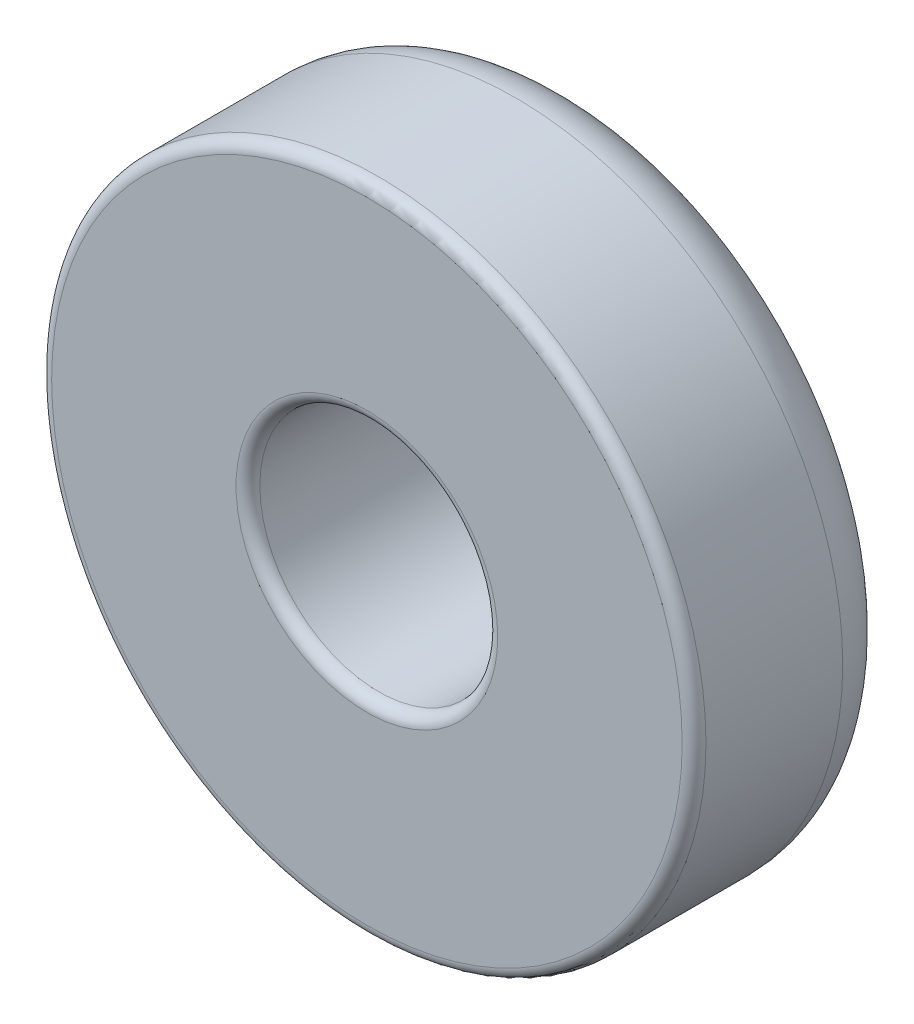
ISO-10303-21;
HEADER;
FILE_DESCRIPTION(('STEP AP214'),'2;1');
FILE_NAME('part.step','',(''),(''),'','','');
FILE_SCHEMA(('AUTOMOTIVE_DESIGN { 1 0 10303 214 1 1 1 1 }'));
ENDSEC;
DATA;
#1=APPLICATION_CONTEXT('core data for automotive mechanical design processes');
#2=APPLICATION_PROTOCOL_DEFINITION('international standard','automotive_design',2000,#1);
#3=PRODUCT_CONTEXT('',#1,'mechanical');
#4=PRODUCT('Part','Part','',(#3));
#5=PRODUCT_RELATED_PRODUCT_CATEGORY('part','',(#4));
#6=PRODUCT_DEFINITION_FORMATION('','',#4);
#7=PRODUCT_DEFINITION_CONTEXT('part definition',#1,'design');
#8=PRODUCT_DEFINITION('design','',#6,#7);
#9=PRODUCT_DEFINITION_SHAPE('','',#8);
#10=(LENGTH_UNIT() NAMED_UNIT(*) SI_UNIT(.MILLI.,.METRE.));
#11=(NAMED_UNIT(*) PLANE_ANGLE_UNIT() SI_UNIT($,.RADIAN.));
#12=(NAMED_UNIT(*) SI_UNIT($,.STERADIAN.) SOLID_ANGLE_UNIT());
#13=UNCERTAINTY_MEASURE_WITH_UNIT(LENGTH_MEASURE(1.E-05),#10,'distance_accuracy_value','');
#14=(GEOMETRIC_REPRESENTATION_CONTEXT(3) GLOBAL_UNCERTAINTY_ASSIGNED_CONTEXT((#13)) GLOBAL_UNIT_ASSIGNED_CONTEXT((#10,
#11,#12)) REPRESENTATION_CONTEXT('',''));
#15=CARTESIAN_POINT('',(0.,0.,0.));
#16=DIRECTION('',(0.,0.,1.));
#17=DIRECTION('',(1.,0.,0.));
#18=AXIS2_PLACEMENT_3D('',#15,#16,#17);
#19=CARTESIAN_POINT('',(0.,0.,1.75));
#20=DIRECTION('',(0.,0.,1.));
#21=DIRECTION('',(1.,0.,0.));
#22=AXIS2_PLACEMENT_3D('',#19,#20,#21);
#23=PLANE('',#22);
#24=CARTESIAN_POINT('',(0.,0.,1.75));
#25=DIRECTION('',(0.,0.,1.));
#26=DIRECTION('',(1.,0.,0.));
#27=AXIS2_PLACEMENT_3D('',#24,#25,#26);
#28=CIRCLE('',#27,1.1);
#29=CARTESIAN_POINT('',(1.1,0.,1.75));
#30=VERTEX_POINT('',#29);
#31=EDGE_CURVE('E44',#30,#30,#28,.F.);
#32=ORIENTED_EDGE('',*,*,#31,.T.);
#33=EDGE_LOOP('',(#32));
#34=FACE_BOUND('',#33,.T.);
#35=CARTESIAN_POINT('',(0.,0.,1.75));
#36=DIRECTION('',(0.,0.,1.));
#37=DIRECTION('',(1.,0.,0.));
#38=AXIS2_PLACEMENT_3D('',#35,#36,#37);
#39=CIRCLE('',#38,2.65);
#40=CARTESIAN_POINT('',(2.65,0.,1.75));
#41=VERTEX_POINT('',#40);
#42=EDGE_CURVE('E48',#41,#41,#39,.T.);
#43=ORIENTED_EDGE('',*,*,#42,.T.);
#44=EDGE_LOOP('',(#43));
#45=FACE_BOUND('',#44,.T.);
#46=ADVANCED_FACE('F37',(#34,#45),#23,.T.);
#47=CARTESIAN_POINT('',(0.,0.,0.));
#48=DIRECTION('',(0.,0.,1.));
#49=DIRECTION('',(1.,0.,0.));
#50=AXIS2_PLACEMENT_3D('',#47,#48,#49);
#51=PLANE('',#50);
#52=CARTESIAN_POINT('',(0.,0.,0.));
#53=DIRECTION('',(0.,0.,1.));
#54=DIRECTION('',(1.,0.,0.));
#55=AXIS2_PLACEMENT_3D('',#52,#53,#54);
#56=CIRCLE('',#55,1.1);
#57=CARTESIAN_POINT('',(1.1,0.,0.));
#58=VERTEX_POINT('',#57);
#59=EDGE_CURVE('E60',#58,#58,#56,.T.);
#60=ORIENTED_EDGE('',*,*,#59,.T.);
#61=EDGE_LOOP('',(#60));
#62=FACE_BOUND('',#61,.T.);
#63=CARTESIAN_POINT('',(0.,0.,0.));
#64=DIRECTION('',(0.,0.,1.));
#65=DIRECTION('',(1.,0.,0.));
#66=AXIS2_PLACEMENT_3D('',#63,#64,#65);
#67=CIRCLE('',#66,2.25);
#68=CARTESIAN_POINT('',(2.25,0.,0.));
#69=VERTEX_POINT('',#68);
#70=EDGE_CURVE('E63',#69,#69,#67,.F.);
#71=ORIENTED_EDGE('',*,*,#70,.T.);
#72=EDGE_LOOP('',(#71));
#73=FACE_BOUND('',#72,.T.);
#74=ADVANCED_FACE('F90',(#62,#73),#51,.F.);
#75=CARTESIAN_POINT('',(0.,0.,1.75));
#76=DIRECTION('',(0.,0.,-1.));
#77=DIRECTION('',(-1.,0.,0.));
#78=AXIS2_PLACEMENT_3D('',#75,#76,#77);
#79=CYLINDRICAL_SURFACE('',#78,2.75);
#80=CARTESIAN_POINT('',(0.,0.,1.65));
#81=DIRECTION('',(0.,0.,1.));
#82=DIRECTION('',(1.,0.,0.));
#83=AXIS2_PLACEMENT_3D('',#80,#81,#82);
#84=CIRCLE('',#83,2.75);
#85=CARTESIAN_POINT('',(2.75,0.,1.65));
#86=VERTEX_POINT('',#85);
#87=EDGE_CURVE('E11',#86,#86,#84,.F.);
#88=ORIENTED_EDGE('',*,*,#87,.T.);
#89=EDGE_LOOP('',(#88));
#90=FACE_BOUND('',#89,.T.);
#91=CARTESIAN_POINT('',(0.,0.,0.5));
#92=DIRECTION('',(0.,0.,1.));
#93=DIRECTION('',(1.,0.,0.));
#94=AXIS2_PLACEMENT_3D('',#91,#92,#93);
#95=CIRCLE('',#94,2.75);
#96=CARTESIAN_POINT('',(2.75,0.,0.5));
#97=VERTEX_POINT('',#96);
#98=EDGE_CURVE('E66',#97,#97,#95,.T.);
#99=ORIENTED_EDGE('',*,*,#98,.T.);
#100=EDGE_LOOP('',(#99));
#101=FACE_BOUND('',#100,.T.);
#102=ADVANCED_FACE('F70',(#90,#101),#79,.T.);
#103=CARTESIAN_POINT('',(0.,0.,1.75));
#104=DIRECTION('',(0.,0.,-1.));
#105=DIRECTION('',(-1.,0.,0.));
#106=AXIS2_PLACEMENT_3D('',#103,#104,#105);
#107=CYLINDRICAL_SURFACE('',#106,1.);
#108=CARTESIAN_POINT('',(0.,0.,0.1));
#109=DIRECTION('',(0.,0.,1.));
#110=DIRECTION('',(1.,0.,0.));
#111=AXIS2_PLACEMENT_3D('',#108,#109,#110);
#112=CIRCLE('',#111,1.);
#113=CARTESIAN_POINT('',(1.,0.,0.1));
#114=VERTEX_POINT('',#113);
#115=EDGE_CURVE('E52',#114,#114,#112,.F.);
#116=ORIENTED_EDGE('',*,*,#115,.T.);
#117=EDGE_LOOP('',(#116));
#118=FACE_BOUND('',#117,.T.);
#119=CARTESIAN_POINT('',(0.,0.,1.65));
#120=DIRECTION('',(0.,0.,1.));
#121=DIRECTION('',(1.,0.,0.));
#122=AXIS2_PLACEMENT_3D('',#119,#120,#121);
#123=CIRCLE('',#122,1.);
#124=CARTESIAN_POINT('',(1.,0.,1.65));
#125=VERTEX_POINT('',#124);
#126=EDGE_CURVE('E57',#125,#125,#123,.T.);
#127=ORIENTED_EDGE('',*,*,#126,.T.);
#128=EDGE_LOOP('',(#127));
#129=FACE_BOUND('',#128,.T.);
#130=ADVANCED_FACE('F75',(#118,#129),#107,.F.);
#131=CARTESIAN_POINT('',(0.,0.,0.5));
#132=DIRECTION('',(0.,0.,1.));
#133=DIRECTION('',(1.,0.,0.));
#134=AXIS2_PLACEMENT_3D('',#131,#132,#133);
#135=TOROIDAL_SURFACE('',#134,2.25,0.5);
#136=ORIENTED_EDGE('',*,*,#70,.F.);
#137=EDGE_LOOP('',(#136));
#138=FACE_BOUND('',#137,.T.);
#139=ORIENTED_EDGE('',*,*,#98,.F.);
#140=EDGE_LOOP('',(#139));
#141=FACE_BOUND('',#140,.T.);
#142=ADVANCED_FACE('F72',(#138,#141),#135,.T.);
#143=CARTESIAN_POINT('',(0.,0.,0.1));
#144=DIRECTION('',(0.,0.,1.));
#145=DIRECTION('',(1.,0.,0.));
#146=AXIS2_PLACEMENT_3D('',#143,#144,#145);
#147=TOROIDAL_SURFACE('',#146,1.1,0.1);
#148=ORIENTED_EDGE('',*,*,#115,.F.);
#149=EDGE_LOOP('',(#148));
#150=FACE_BOUND('',#149,.T.);
#151=ORIENTED_EDGE('',*,*,#59,.F.);
#152=EDGE_LOOP('',(#151));
#153=FACE_BOUND('',#152,.T.);
#154=ADVANCED_FACE('F74',(#150,#153),#147,.T.);
#155=CARTESIAN_POINT('',(0.,0.,1.65));
#156=DIRECTION('',(0.,0.,1.));
#157=DIRECTION('',(1.,0.,0.));
#158=AXIS2_PLACEMENT_3D('',#155,#156,#157);
#159=TOROIDAL_SURFACE('',#158,1.1,0.1);
#160=ORIENTED_EDGE('',*,*,#31,.F.);
#161=EDGE_LOOP('',(#160));
#162=FACE_BOUND('',#161,.T.);
#163=ORIENTED_EDGE('',*,*,#126,.F.);
#164=EDGE_LOOP('',(#163));
#165=FACE_BOUND('',#164,.T.);
#166=ADVANCED_FACE('F82',(#162,#165),#159,.T.);
#167=CARTESIAN_POINT('',(0.,0.,1.65));
#168=DIRECTION('',(0.,0.,1.));
#169=DIRECTION('',(1.,0.,0.));
#170=AXIS2_PLACEMENT_3D('',#167,#168,#169);
#171=TOROIDAL_SURFACE('',#170,2.65,0.1);
#172=ORIENTED_EDGE('',*,*,#87,.F.);
#173=EDGE_LOOP('',(#172));
#174=FACE_BOUND('',#173,.T.);
#175=ORIENTED_EDGE('',*,*,#42,.F.);
#176=EDGE_LOOP('',(#175));
#177=FACE_BOUND('',#176,.T.);
#178=ADVANCED_FACE('F39',(#174,#177),#171,.T.);
#179=CLOSED_SHELL('',(#46,#74,#102,#130,#142,#154,#166,#178));
#180=MANIFOLD_SOLID_BREP('B2',#179);
#181=ADVANCED_BREP_SHAPE_REPRESENTATION('',(#18,#180),#14);
#182=SHAPE_DEFINITION_REPRESENTATION(#9,#181);
ENDSEC;
END-ISO-10303-21;
